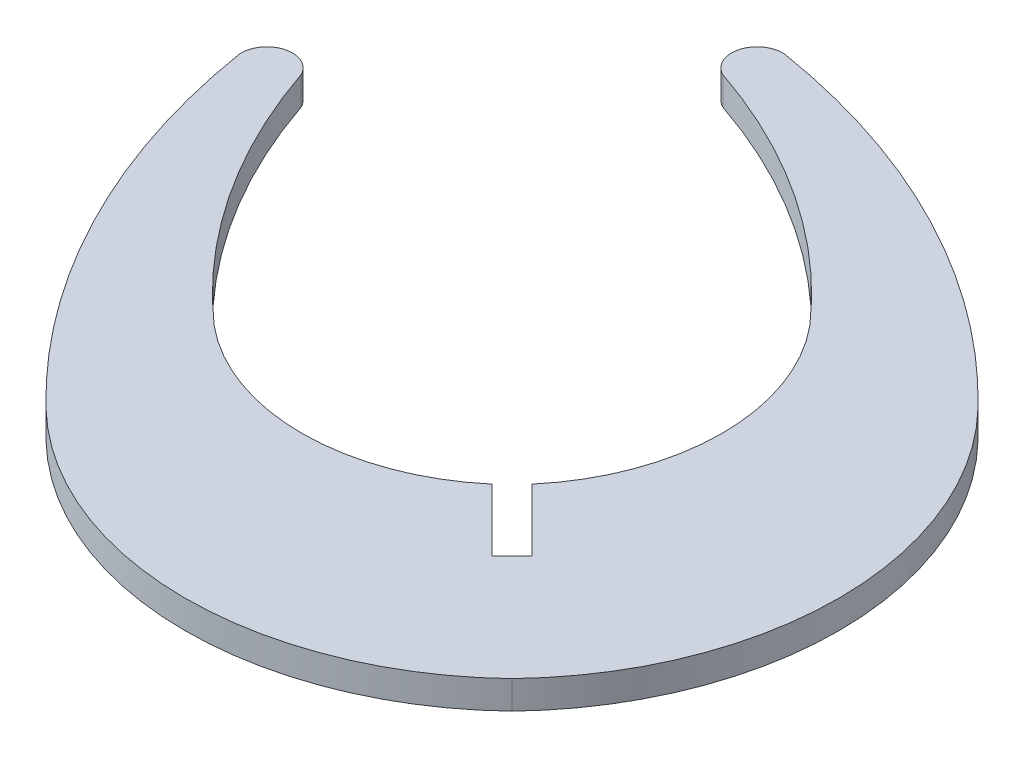
ISO-10303-21;
HEADER;
FILE_DESCRIPTION(('STEP AP214'),'2;1');
FILE_NAME('part.step','',(''),(''),'','','');
FILE_SCHEMA(('AUTOMOTIVE_DESIGN { 1 0 10303 214 1 1 1 1 }'));
ENDSEC;
DATA;
#1=APPLICATION_CONTEXT('core data for automotive mechanical design processes');
#2=APPLICATION_PROTOCOL_DEFINITION('international standard','automotive_design',2000,#1);
#3=PRODUCT_CONTEXT('',#1,'mechanical');
#4=PRODUCT('Part','Part','',(#3));
#5=PRODUCT_RELATED_PRODUCT_CATEGORY('part','',(#4));
#6=PRODUCT_DEFINITION_FORMATION('','',#4);
#7=PRODUCT_DEFINITION_CONTEXT('part definition',#1,'design');
#8=PRODUCT_DEFINITION('design','',#6,#7);
#9=PRODUCT_DEFINITION_SHAPE('','',#8);
#10=(LENGTH_UNIT() NAMED_UNIT(*) SI_UNIT(.MILLI.,.METRE.));
#11=(NAMED_UNIT(*) PLANE_ANGLE_UNIT() SI_UNIT($,.RADIAN.));
#12=(NAMED_UNIT(*) SI_UNIT($,.STERADIAN.) SOLID_ANGLE_UNIT());
#13=UNCERTAINTY_MEASURE_WITH_UNIT(LENGTH_MEASURE(1.E-05),#10,'distance_accuracy_value','');
#14=(GEOMETRIC_REPRESENTATION_CONTEXT(3) GLOBAL_UNCERTAINTY_ASSIGNED_CONTEXT((#13)) GLOBAL_UNIT_ASSIGNED_CONTEXT((#10,
#11,#12)) REPRESENTATION_CONTEXT('',''));
#15=CARTESIAN_POINT('',(0.,0.,0.));
#16=DIRECTION('',(0.,0.,1.));
#17=DIRECTION('',(1.,0.,0.));
#18=AXIS2_PLACEMENT_3D('',#15,#16,#17);
#19=CARTESIAN_POINT('',(163.070254813501,1.45,-235.558175859535));
#20=DIRECTION('',(0.,-1.,0.));
#21=DIRECTION('',(0.,0.,-1.));
#22=AXIS2_PLACEMENT_3D('',#19,#20,#21);
#23=CYLINDRICAL_SURFACE('',#22,37.116762535415);
#24=CARTESIAN_POINT('',(163.070254813501,0.,-235.558175859535));
#25=DIRECTION('',(0.,1.,0.));
#26=DIRECTION('',(0.,0.,1.));
#27=AXIS2_PLACEMENT_3D('',#24,#25,#26);
#28=CIRCLE('',#27,37.116762535415);
#29=CARTESIAN_POINT('',(189.707440588787,0.,-261.406084770766));
#30=VERTEX_POINT('',#29);
#31=CARTESIAN_POINT('',(168.953657193377,0.,-272.205681061757));
#32=VERTEX_POINT('',#31);
#33=EDGE_CURVE('E164',#30,#32,#28,.T.);
#34=ORIENTED_EDGE('',*,*,#33,.T.);
#35=DIRECTION('',(0.,-1.,0.));
#36=VECTOR('',#35,1.);
#37=CARTESIAN_POINT('',(168.953657193377,1.45,-272.205681061757));
#38=LINE('',#37,#36);
#39=CARTESIAN_POINT('',(168.953657193377,1.45,-272.205681061757));
#40=VERTEX_POINT('',#39);
#41=EDGE_CURVE('E11',#40,#32,#38,.T.);
#42=ORIENTED_EDGE('',*,*,#41,.F.);
#43=CARTESIAN_POINT('',(163.070254813501,1.45,-235.558175859535));
#44=DIRECTION('',(0.,1.,0.));
#45=DIRECTION('',(0.,0.,1.));
#46=AXIS2_PLACEMENT_3D('',#43,#44,#45);
#47=CIRCLE('',#46,37.116762535415);
#48=CARTESIAN_POINT('',(189.707440588787,1.45,-261.406084770766));
#49=VERTEX_POINT('',#48);
#50=EDGE_CURVE('E196',#49,#40,#47,.T.);
#51=ORIENTED_EDGE('',*,*,#50,.F.);
#52=DIRECTION('',(0.,-1.,0.));
#53=VECTOR('',#52,1.);
#54=CARTESIAN_POINT('',(189.707440588787,1.45,-261.406084770766));
#55=LINE('',#54,#53);
#56=EDGE_CURVE('E160',#49,#30,#55,.T.);
#57=ORIENTED_EDGE('',*,*,#56,.T.);
#58=EDGE_LOOP('',(#34,#42,#51,#57));
#59=FACE_BOUND('',#58,.T.);
#60=ADVANCED_FACE('F37',(#59),#23,.T.);
#61=CARTESIAN_POINT('',(168.875117399296,1.45,-270.888151876468));
#62=DIRECTION('',(0.,-1.,0.));
#63=DIRECTION('',(0.,0.,-1.));
#64=AXIS2_PLACEMENT_3D('',#61,#62,#63);
#65=CYLINDRICAL_SURFACE('',#64,1.31986804391245);
#66=CARTESIAN_POINT('',(168.875117399296,0.,-270.888151876468));
#67=DIRECTION('',(0.,1.,0.));
#68=DIRECTION('',(0.,0.,1.));
#69=AXIS2_PLACEMENT_3D('',#66,#67,#68);
#70=CIRCLE('',#69,1.31986804391245);
#71=CARTESIAN_POINT('',(168.301968776898,0.,-269.699222816354));
#72=VERTEX_POINT('',#71);
#73=EDGE_CURVE('E167',#32,#72,#70,.T.);
#74=ORIENTED_EDGE('',*,*,#73,.T.);
#75=DIRECTION('',(0.,-1.,0.));
#76=VECTOR('',#75,1.);
#77=CARTESIAN_POINT('',(168.301968776898,1.45,-269.699222816354));
#78=LINE('',#77,#76);
#79=CARTESIAN_POINT('',(168.301968776898,1.45,-269.699222816354));
#80=VERTEX_POINT('',#79);
#81=EDGE_CURVE('E45',#80,#72,#78,.T.);
#82=ORIENTED_EDGE('',*,*,#81,.F.);
#83=CARTESIAN_POINT('',(168.875117399296,1.45,-270.888151876468));
#84=DIRECTION('',(0.,1.,0.));
#85=DIRECTION('',(0.,0.,1.));
#86=AXIS2_PLACEMENT_3D('',#83,#84,#85);
#87=CIRCLE('',#86,1.31986804391245);
#88=EDGE_CURVE('E111',#40,#80,#87,.T.);
#89=ORIENTED_EDGE('',*,*,#88,.F.);
#90=ORIENTED_EDGE('',*,*,#41,.T.);
#91=EDGE_LOOP('',(#74,#82,#89,#90));
#92=FACE_BOUND('',#91,.T.);
#93=ADVANCED_FACE('F219',(#92),#65,.T.);
#94=CARTESIAN_POINT('',(158.336954198543,1.45,-240.224535026399));
#95=DIRECTION('',(0.,-1.,0.));
#96=DIRECTION('',(0.,0.,-1.));
#97=AXIS2_PLACEMENT_3D('',#94,#95,#96);
#98=CYLINDRICAL_SURFACE('',#97,31.113642278945);
#99=CARTESIAN_POINT('',(158.336954198543,0.,-240.224535026399));
#100=DIRECTION('',(0.,1.,0.));
#101=DIRECTION('',(0.,0.,1.));
#102=AXIS2_PLACEMENT_3D('',#99,#100,#101);
#103=CIRCLE('',#102,31.113642278945);
#104=CARTESIAN_POINT('',(181.704254491034,0.,-260.767855422643));
#105=VERTEX_POINT('',#104);
#106=EDGE_CURVE('E170',#105,#72,#103,.T.);
#107=ORIENTED_EDGE('',*,*,#106,.F.);
#108=DIRECTION('',(0.,-1.,0.));
#109=VECTOR('',#108,1.);
#110=CARTESIAN_POINT('',(181.704254491034,1.45,-260.767855422643));
#111=LINE('',#110,#109);
#112=CARTESIAN_POINT('',(181.704254491034,1.45,-260.767855422643));
#113=VERTEX_POINT('',#112);
#114=EDGE_CURVE('E212',#113,#105,#111,.T.);
#115=ORIENTED_EDGE('',*,*,#114,.F.);
#116=CARTESIAN_POINT('',(158.336954198543,1.45,-240.224535026399));
#117=DIRECTION('',(0.,1.,0.));
#118=DIRECTION('',(0.,0.,1.));
#119=AXIS2_PLACEMENT_3D('',#116,#117,#118);
#120=CIRCLE('',#119,31.113642278945);
#121=EDGE_CURVE('E218',#113,#80,#120,.T.);
#122=ORIENTED_EDGE('',*,*,#121,.T.);
#123=ORIENTED_EDGE('',*,*,#81,.T.);
#124=EDGE_LOOP('',(#107,#115,#122,#123));
#125=FACE_BOUND('',#124,.T.);
#126=ADVANCED_FACE('F216',(#125),#98,.F.);
#127=CARTESIAN_POINT('',(173.202630980295,1.45,-253.718053428518));
#128=DIRECTION('',(0.,-1.,0.));
#129=DIRECTION('',(0.,0.,-1.));
#130=AXIS2_PLACEMENT_3D('',#127,#128,#129);
#131=CYLINDRICAL_SURFACE('',#130,11.044333862878);
#132=CARTESIAN_POINT('',(173.202630980295,0.,-253.718053428518));
#133=DIRECTION('',(0.,1.,0.));
#134=DIRECTION('',(0.,0.,1.));
#135=AXIS2_PLACEMENT_3D('',#132,#133,#134);
#136=CIRCLE('',#135,11.044333862878);
#137=CARTESIAN_POINT('',(181.62162207116,0.,-246.569773951144));
#138=VERTEX_POINT('',#137);
#139=EDGE_CURVE('E173',#138,#105,#136,.T.);
#140=ORIENTED_EDGE('',*,*,#139,.F.);
#141=DIRECTION('',(0.,-1.,0.));
#142=VECTOR('',#141,1.);
#143=CARTESIAN_POINT('',(181.62162207116,1.45,-246.569773951144));
#144=LINE('',#143,#142);
#145=CARTESIAN_POINT('',(181.62162207116,1.45,-246.569773951144));
#146=VERTEX_POINT('',#145);
#147=EDGE_CURVE('E210',#146,#138,#144,.T.);
#148=ORIENTED_EDGE('',*,*,#147,.F.);
#149=CARTESIAN_POINT('',(173.202630980295,1.45,-253.718053428518));
#150=DIRECTION('',(0.,1.,0.));
#151=DIRECTION('',(0.,0.,1.));
#152=AXIS2_PLACEMENT_3D('',#149,#150,#151);
#153=CIRCLE('',#152,11.044333862878);
#154=EDGE_CURVE('E231',#146,#113,#153,.T.);
#155=ORIENTED_EDGE('',*,*,#154,.T.);
#156=ORIENTED_EDGE('',*,*,#114,.T.);
#157=EDGE_LOOP('',(#140,#148,#155,#156));
#158=FACE_BOUND('',#157,.T.);
#159=ADVANCED_FACE('F227',(#158),#131,.F.);
#160=CARTESIAN_POINT('',(56.4620728425831,1.45,-371.729312218077));
#161=DIRECTION('',(0.707106750221858,0.,-0.707106812151235));
#162=DIRECTION('',(-0.707106812151235,0.,-0.707106750221859));
#163=AXIS2_PLACEMENT_3D('',#160,#161,#162);
#164=PLANE('',#163);
#165=DIRECTION('',(0.707106812151235,0.,0.707106750221859));
#166=VECTOR('',#165,1.);
#167=CARTESIAN_POINT('',(56.4620728425831,0.,-371.729312218077));
#168=LINE('',#167,#166);
#169=CARTESIAN_POINT('',(184.817606994601,0.,-243.373789307611));
#170=VERTEX_POINT('',#169);
#171=EDGE_CURVE('E176',#138,#170,#168,.T.);
#172=ORIENTED_EDGE('',*,*,#171,.T.);
#173=DIRECTION('',(0.,-1.,0.));
#174=VECTOR('',#173,1.);
#175=CARTESIAN_POINT('',(184.817606994601,1.45,-243.373789307611));
#176=LINE('',#175,#174);
#177=CARTESIAN_POINT('',(184.817606994601,1.45,-243.373789307611));
#178=VERTEX_POINT('',#177);
#179=EDGE_CURVE('E208',#178,#170,#176,.T.);
#180=ORIENTED_EDGE('',*,*,#179,.F.);
#181=DIRECTION('',(0.707106812151235,0.,0.707106750221859));
#182=VECTOR('',#181,1.);
#183=CARTESIAN_POINT('',(56.4620728425831,1.45,-371.729312218077));
#184=LINE('',#183,#182);
#185=EDGE_CURVE('E233',#146,#178,#184,.T.);
#186=ORIENTED_EDGE('',*,*,#185,.F.);
#187=ORIENTED_EDGE('',*,*,#147,.T.);
#188=EDGE_LOOP('',(#172,#180,#186,#187));
#189=FACE_BOUND('',#188,.T.);
#190=ADVANCED_FACE('F352',(#189),#164,.F.);
#191=CARTESIAN_POINT('',(79.9949644669364,1.45,-138.551146779946));
#192=DIRECTION('',(-0.707106781186547,0.,-0.707106781186547));
#193=DIRECTION('',(-0.707106781186548,0.,0.707106781186548));
#194=AXIS2_PLACEMENT_3D('',#191,#192,#193);
#195=PLANE('',#194);
#196=DIRECTION('',(0.707106781186548,0.,-0.707106781186548));
#197=VECTOR('',#196,1.);
#198=CARTESIAN_POINT('',(79.9949644669364,0.,-138.551146779946));
#199=LINE('',#198,#197);
#200=CARTESIAN_POINT('',(183.78664402343,0.,-242.34282633644));
#201=VERTEX_POINT('',#200);
#202=EDGE_CURVE('E179',#201,#170,#199,.T.);
#203=ORIENTED_EDGE('',*,*,#202,.F.);
#204=DIRECTION('',(0.,-1.,0.));
#205=VECTOR('',#204,1.);
#206=CARTESIAN_POINT('',(183.78664402343,1.45,-242.34282633644));
#207=LINE('',#206,#205);
#208=CARTESIAN_POINT('',(183.78664402343,1.45,-242.34282633644));
#209=VERTEX_POINT('',#208);
#210=EDGE_CURVE('E206',#209,#201,#207,.T.);
#211=ORIENTED_EDGE('',*,*,#210,.F.);
#212=DIRECTION('',(0.707106781186548,0.,-0.707106781186548));
#213=VECTOR('',#212,1.);
#214=CARTESIAN_POINT('',(79.9949644669364,1.45,-138.551146779946));
#215=LINE('',#214,#213);
#216=EDGE_CURVE('E239',#209,#178,#215,.T.);
#217=ORIENTED_EDGE('',*,*,#216,.T.);
#218=ORIENTED_EDGE('',*,*,#179,.T.);
#219=EDGE_LOOP('',(#203,#211,#217,#218));
#220=FACE_BOUND('',#219,.T.);
#221=ADVANCED_FACE('F342',(#220),#195,.T.);
#222=CARTESIAN_POINT('',(55.4311115278609,1.45,-370.698349372254));
#223=DIRECTION('',(0.707106755129792,0.,-0.707106807243302));
#224=DIRECTION('',(-0.707106807243302,0.,-0.707106755129792));
#225=AXIS2_PLACEMENT_3D('',#222,#223,#224);
#226=PLANE('',#225);
#227=DIRECTION('',(0.707106807243302,0.,0.707106755129792));
#228=VECTOR('',#227,1.);
#229=CARTESIAN_POINT('',(55.4311115278609,0.,-370.698349372254));
#230=LINE('',#229,#228);
#231=CARTESIAN_POINT('',(180.590658902847,0.,-245.53881122148));
#232=VERTEX_POINT('',#231);
#233=EDGE_CURVE('E182',#232,#201,#230,.T.);
#234=ORIENTED_EDGE('',*,*,#233,.F.);
#235=DIRECTION('',(0.,-1.,0.));
#236=VECTOR('',#235,1.);
#237=CARTESIAN_POINT('',(180.590658902847,1.45,-245.53881122148));
#238=LINE('',#237,#236);
#239=CARTESIAN_POINT('',(180.590658902847,1.45,-245.53881122148));
#240=VERTEX_POINT('',#239);
#241=EDGE_CURVE('E204',#240,#232,#238,.T.);
#242=ORIENTED_EDGE('',*,*,#241,.F.);
#243=DIRECTION('',(0.707106807243302,0.,0.707106755129792));
#244=VECTOR('',#243,1.);
#245=CARTESIAN_POINT('',(55.4311115278609,1.45,-370.698349372254));
#246=LINE('',#245,#244);
#247=EDGE_CURVE('E242',#240,#209,#246,.T.);
#248=ORIENTED_EDGE('',*,*,#247,.T.);
#249=ORIENTED_EDGE('',*,*,#210,.T.);
#250=EDGE_LOOP('',(#234,#242,#248,#249));
#251=FACE_BOUND('',#250,.T.);
#252=ADVANCED_FACE('F333',(#251),#226,.T.);
#253=CARTESIAN_POINT('',(173.442379750904,1.45,-253.95780226988));
#254=DIRECTION('',(0.,-1.,0.));
#255=DIRECTION('',(0.,0.,-1.));
#256=AXIS2_PLACEMENT_3D('',#253,#254,#255);
#257=CYLINDRICAL_SURFACE('',#256,11.044333619877);
#258=CARTESIAN_POINT('',(173.442379750904,0.,-253.95780226988));
#259=DIRECTION('',(0.,1.,0.));
#260=DIRECTION('',(0.,0.,1.));
#261=AXIS2_PLACEMENT_3D('',#258,#259,#260);
#262=CIRCLE('',#261,11.044333619877);
#263=CARTESIAN_POINT('',(166.392576376631,0.,-245.456180219281));
#264=VERTEX_POINT('',#263);
#265=EDGE_CURVE('E185',#264,#232,#262,.T.);
#266=ORIENTED_EDGE('',*,*,#265,.F.);
#267=DIRECTION('',(0.,-1.,0.));
#268=VECTOR('',#267,1.);
#269=CARTESIAN_POINT('',(166.392576376631,1.45,-245.456180219281));
#270=LINE('',#269,#268);
#271=CARTESIAN_POINT('',(166.392576376631,1.45,-245.456180219281));
#272=VERTEX_POINT('',#271);
#273=EDGE_CURVE('E202',#272,#264,#270,.T.);
#274=ORIENTED_EDGE('',*,*,#273,.F.);
#275=CARTESIAN_POINT('',(173.442379750904,1.45,-253.95780226988));
#276=DIRECTION('',(0.,1.,0.));
#277=DIRECTION('',(0.,0.,1.));
#278=AXIS2_PLACEMENT_3D('',#275,#276,#277);
#279=CIRCLE('',#278,11.044333619877);
#280=EDGE_CURVE('E245',#272,#240,#279,.T.);
#281=ORIENTED_EDGE('',*,*,#280,.T.);
#282=ORIENTED_EDGE('',*,*,#241,.T.);
#283=EDGE_LOOP('',(#266,#274,#281,#282));
#284=FACE_BOUND('',#283,.T.);
#285=ADVANCED_FACE('F258',(#284),#257,.F.);
#286=CARTESIAN_POINT('',(186.93589826457,1.45,-268.82347920035));
#287=DIRECTION('',(0.,-1.,0.));
#288=DIRECTION('',(0.,0.,-1.));
#289=AXIS2_PLACEMENT_3D('',#286,#287,#288);
#290=CYLINDRICAL_SURFACE('',#289,31.113642278945);
#291=CARTESIAN_POINT('',(186.93589826457,0.,-268.82347920035));
#292=DIRECTION('',(0.,1.,0.));
#293=DIRECTION('',(0.,0.,1.));
#294=AXIS2_PLACEMENT_3D('',#291,#292,#293);
#295=CIRCLE('',#294,31.113642278945);
#296=CARTESIAN_POINT('',(157.461210140959,0.,-258.858465608888));
#297=VERTEX_POINT('',#296);
#298=EDGE_CURVE('E188',#297,#264,#295,.T.);
#299=ORIENTED_EDGE('',*,*,#298,.F.);
#300=DIRECTION('',(0.,-1.,0.));
#301=VECTOR('',#300,1.);
#302=CARTESIAN_POINT('',(157.461210140959,1.45,-258.858465608888));
#303=LINE('',#302,#301);
#304=CARTESIAN_POINT('',(157.461210140959,1.45,-258.858465608888));
#305=VERTEX_POINT('',#304);
#306=EDGE_CURVE('E200',#305,#297,#303,.T.);
#307=ORIENTED_EDGE('',*,*,#306,.F.);
#308=CARTESIAN_POINT('',(186.93589826457,1.45,-268.82347920035));
#309=DIRECTION('',(0.,1.,0.));
#310=DIRECTION('',(0.,0.,1.));
#311=AXIS2_PLACEMENT_3D('',#308,#309,#310);
#312=CIRCLE('',#311,31.113642278945);
#313=EDGE_CURVE('E248',#305,#272,#312,.T.);
#314=ORIENTED_EDGE('',*,*,#313,.T.);
#315=ORIENTED_EDGE('',*,*,#273,.T.);
#316=EDGE_LOOP('',(#299,#307,#314,#315));
#317=FACE_BOUND('',#316,.T.);
#318=ADVANCED_FACE('F252',(#317),#290,.F.);
#319=CARTESIAN_POINT('',(156.272281516117,1.45,-258.285316336043));
#320=DIRECTION('',(0.,-1.,0.));
#321=DIRECTION('',(0.,0.,-1.));
#322=AXIS2_PLACEMENT_3D('',#319,#320,#321);
#323=CYLINDRICAL_SURFACE('',#322,1.31986793427648);
#324=CARTESIAN_POINT('',(156.272281516117,0.,-258.285316336043));
#325=DIRECTION('',(0.,1.,0.));
#326=DIRECTION('',(0.,0.,1.));
#327=AXIS2_PLACEMENT_3D('',#324,#325,#326);
#328=CIRCLE('',#327,1.31986793427648);
#329=CARTESIAN_POINT('',(154.954752574915,0.,-258.206774289818));
#330=VERTEX_POINT('',#329);
#331=EDGE_CURVE('E191',#297,#330,#328,.T.);
#332=ORIENTED_EDGE('',*,*,#331,.T.);
#333=DIRECTION('',(0.,-1.,0.));
#334=VECTOR('',#333,1.);
#335=CARTESIAN_POINT('',(154.954752574915,1.45,-258.206774289818));
#336=LINE('',#335,#334);
#337=CARTESIAN_POINT('',(154.954752574915,1.45,-258.206774289818));
#338=VERTEX_POINT('',#337);
#339=EDGE_CURVE('E155',#338,#330,#336,.T.);
#340=ORIENTED_EDGE('',*,*,#339,.F.);
#341=CARTESIAN_POINT('',(156.272281516117,1.45,-258.285316336043));
#342=DIRECTION('',(0.,1.,0.));
#343=DIRECTION('',(0.,0.,1.));
#344=AXIS2_PLACEMENT_3D('',#341,#342,#343);
#345=CIRCLE('',#344,1.31986793427648);
#346=EDGE_CURVE('E146',#305,#338,#345,.T.);
#347=ORIENTED_EDGE('',*,*,#346,.F.);
#348=ORIENTED_EDGE('',*,*,#306,.T.);
#349=EDGE_LOOP('',(#332,#340,#347,#348));
#350=FACE_BOUND('',#349,.T.);
#351=ADVANCED_FACE('F262',(#350),#323,.T.);
#352=CARTESIAN_POINT('',(191.602257773278,1.45,-264.090178226755));
#353=DIRECTION('',(0.,-1.,0.));
#354=DIRECTION('',(0.,0.,-1.));
#355=AXIS2_PLACEMENT_3D('',#352,#353,#354);
#356=CYLINDRICAL_SURFACE('',#355,37.116762778416);
#357=CARTESIAN_POINT('',(191.602257773278,0.,-264.090178226755));
#358=DIRECTION('',(0.,1.,0.));
#359=DIRECTION('',(0.,0.,1.));
#360=AXIS2_PLACEMENT_3D('',#357,#358,#359);
#361=CIRCLE('',#360,37.116762778416);
#362=CARTESIAN_POINT('',(165.754346718504,0.,-237.452994192895));
#363=VERTEX_POINT('',#362);
#364=EDGE_CURVE('E154',#330,#363,#361,.T.);
#365=ORIENTED_EDGE('',*,*,#364,.T.);
#366=DIRECTION('',(0.,-1.,0.));
#367=VECTOR('',#366,1.);
#368=CARTESIAN_POINT('',(165.754346718504,1.45,-237.452994192895));
#369=LINE('',#368,#367);
#370=CARTESIAN_POINT('',(165.754346718504,1.45,-237.452994192895));
#371=VERTEX_POINT('',#370);
#372=EDGE_CURVE('E151',#371,#363,#369,.T.);
#373=ORIENTED_EDGE('',*,*,#372,.F.);
#374=CARTESIAN_POINT('',(191.602257773278,1.45,-264.090178226755));
#375=DIRECTION('',(0.,1.,0.));
#376=DIRECTION('',(0.,0.,1.));
#377=AXIS2_PLACEMENT_3D('',#374,#375,#376);
#378=CIRCLE('',#377,37.116762778416);
#379=EDGE_CURVE('E139',#338,#371,#378,.T.);
#380=ORIENTED_EDGE('',*,*,#379,.F.);
#381=ORIENTED_EDGE('',*,*,#339,.T.);
#382=EDGE_LOOP('',(#365,#373,#380,#381));
#383=FACE_BOUND('',#382,.T.);
#384=ADVANCED_FACE('F152',(#383),#356,.T.);
#385=CARTESIAN_POINT('',(177.789943675642,1.45,-249.856099632808));
#386=DIRECTION('',(0.,-1.,0.));
#387=DIRECTION('',(0.,0.,-1.));
#388=AXIS2_PLACEMENT_3D('',#385,#386,#387);
#389=CYLINDRICAL_SURFACE('',#388,17.282726019592);
#390=CARTESIAN_POINT('',(177.789943675642,0.,-249.856099632808));
#391=DIRECTION('',(0.,1.,0.));
#392=DIRECTION('',(0.,0.,1.));
#393=AXIS2_PLACEMENT_3D('',#390,#391,#392);
#394=CIRCLE('',#393,17.282726019592);
#395=CARTESIAN_POINT('',(189.765459036896,0.,-237.394974061631));
#396=VERTEX_POINT('',#395);
#397=EDGE_CURVE('E97',#363,#396,#394,.T.);
#398=ORIENTED_EDGE('',*,*,#397,.T.);
#399=DIRECTION('',(0.,-1.,0.));
#400=VECTOR('',#399,1.);
#401=CARTESIAN_POINT('',(189.765459036896,1.45,-237.394974061631));
#402=LINE('',#401,#400);
#403=CARTESIAN_POINT('',(189.765459036896,1.45,-237.394974061631));
#404=VERTEX_POINT('',#403);
#405=EDGE_CURVE('E156',#404,#396,#402,.T.);
#406=ORIENTED_EDGE('',*,*,#405,.F.);
#407=CARTESIAN_POINT('',(177.789943675642,1.45,-249.856099632808));
#408=DIRECTION('',(0.,1.,0.));
#409=DIRECTION('',(0.,0.,1.));
#410=AXIS2_PLACEMENT_3D('',#407,#408,#409);
#411=CIRCLE('',#410,17.282726019592);
#412=EDGE_CURVE('E143',#371,#404,#411,.T.);
#413=ORIENTED_EDGE('',*,*,#412,.F.);
#414=ORIENTED_EDGE('',*,*,#372,.T.);
#415=EDGE_LOOP('',(#398,#406,#413,#414));
#416=FACE_BOUND('',#415,.T.);
#417=ADVANCED_FACE('F158',(#416),#389,.T.);
#418=CARTESIAN_POINT('',(177.304333526215,1.45,-249.370489485835));
#419=DIRECTION('',(0.,-1.,0.));
#420=DIRECTION('',(0.,0.,-1.));
#421=AXIS2_PLACEMENT_3D('',#418,#419,#420);
#422=CYLINDRICAL_SURFACE('',#421,17.282726019592);
#423=CARTESIAN_POINT('',(177.304333526215,0.,-249.370489485835));
#424=DIRECTION('',(0.,1.,0.));
#425=DIRECTION('',(0.,0.,1.));
#426=AXIS2_PLACEMENT_3D('',#423,#424,#425);
#427=CIRCLE('',#426,17.282726019592);
#428=EDGE_CURVE('E103',#396,#30,#427,.T.);
#429=ORIENTED_EDGE('',*,*,#428,.T.);
#430=ORIENTED_EDGE('',*,*,#56,.F.);
#431=CARTESIAN_POINT('',(177.304333526215,1.45,-249.370489485835));
#432=DIRECTION('',(0.,1.,0.));
#433=DIRECTION('',(0.,0.,1.));
#434=AXIS2_PLACEMENT_3D('',#431,#432,#433);
#435=CIRCLE('',#434,17.282726019592);
#436=EDGE_CURVE('E53',#404,#49,#435,.T.);
#437=ORIENTED_EDGE('',*,*,#436,.F.);
#438=ORIENTED_EDGE('',*,*,#405,.T.);
#439=EDGE_LOOP('',(#429,#430,#437,#438));
#440=FACE_BOUND('',#439,.T.);
#441=ADVANCED_FACE('F277',(#440),#422,.T.);
#442=CARTESIAN_POINT('',(-48.360559474051,1.45,-266.906670720934));
#443=DIRECTION('',(0.,1.,0.));
#444=DIRECTION('',(0.,0.,1.));
#445=AXIS2_PLACEMENT_3D('',#442,#443,#444);
#446=PLANE('',#445);
#447=ORIENTED_EDGE('',*,*,#50,.T.);
#448=ORIENTED_EDGE('',*,*,#88,.T.);
#449=ORIENTED_EDGE('',*,*,#121,.F.);
#450=ORIENTED_EDGE('',*,*,#154,.F.);
#451=ORIENTED_EDGE('',*,*,#185,.T.);
#452=ORIENTED_EDGE('',*,*,#216,.F.);
#453=ORIENTED_EDGE('',*,*,#247,.F.);
#454=ORIENTED_EDGE('',*,*,#280,.F.);
#455=ORIENTED_EDGE('',*,*,#313,.F.);
#456=ORIENTED_EDGE('',*,*,#346,.T.);
#457=ORIENTED_EDGE('',*,*,#379,.T.);
#458=ORIENTED_EDGE('',*,*,#412,.T.);
#459=ORIENTED_EDGE('',*,*,#436,.T.);
#460=EDGE_LOOP('',(#447,#448,#449,#450,#451,#452,#453,#454,#455,#456,#457,#458,#459));
#461=FACE_BOUND('',#460,.T.);
#462=ADVANCED_FACE('F141',(#461),#446,.T.);
#463=CARTESIAN_POINT('',(-48.360559474051,0.,-266.906670720934));
#464=DIRECTION('',(0.,1.,0.));
#465=DIRECTION('',(0.,0.,1.));
#466=AXIS2_PLACEMENT_3D('',#463,#464,#465);
#467=PLANE('',#466);
#468=ORIENTED_EDGE('',*,*,#33,.F.);
#469=ORIENTED_EDGE('',*,*,#428,.F.);
#470=ORIENTED_EDGE('',*,*,#397,.F.);
#471=ORIENTED_EDGE('',*,*,#364,.F.);
#472=ORIENTED_EDGE('',*,*,#331,.F.);
#473=ORIENTED_EDGE('',*,*,#298,.T.);
#474=ORIENTED_EDGE('',*,*,#265,.T.);
#475=ORIENTED_EDGE('',*,*,#233,.T.);
#476=ORIENTED_EDGE('',*,*,#202,.T.);
#477=ORIENTED_EDGE('',*,*,#171,.F.);
#478=ORIENTED_EDGE('',*,*,#139,.T.);
#479=ORIENTED_EDGE('',*,*,#106,.T.);
#480=ORIENTED_EDGE('',*,*,#73,.F.);
#481=EDGE_LOOP('',(#468,#469,#470,#471,#472,#473,#474,#475,#476,#477,#478,#479,#480));
#482=FACE_BOUND('',#481,.T.);
#483=ADVANCED_FACE('F223',(#482),#467,.F.);
#484=CLOSED_SHELL('',(#60,#93,#126,#159,#190,#221,#252,#285,#318,#351,#384,#417,#441,#462,#483));
#485=MANIFOLD_SOLID_BREP('B2',#484);
#486=ADVANCED_BREP_SHAPE_REPRESENTATION('',(#18,#485),#14);
#487=SHAPE_DEFINITION_REPRESENTATION(#9,#486);
ENDSEC;
END-ISO-10303-21;
